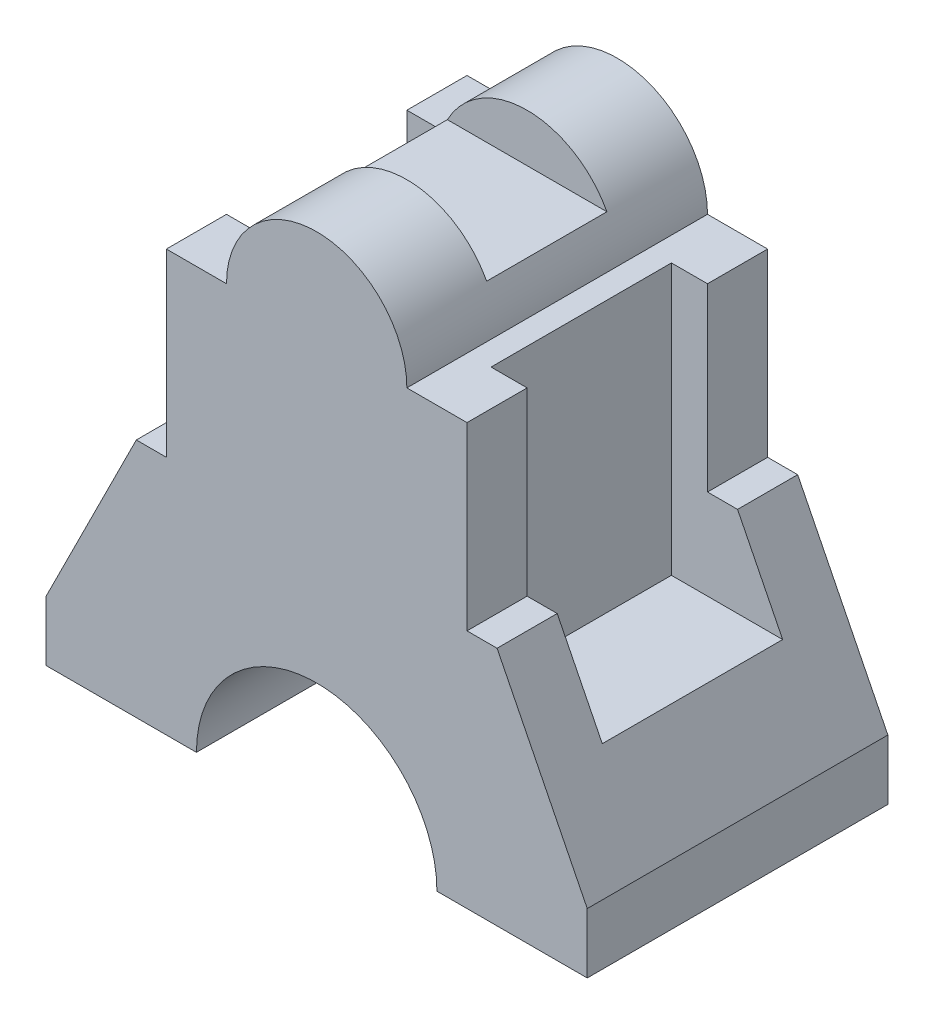
ISO-10303-21;
HEADER;
FILE_DESCRIPTION(('STEP AP214'),'2;1');
FILE_NAME('part.step','',(''),(''),'','','');
FILE_SCHEMA(('AUTOMOTIVE_DESIGN { 1 0 10303 214 1 1 1 1 }'));
ENDSEC;
DATA;
#1=APPLICATION_CONTEXT('core data for automotive mechanical design processes');
#2=APPLICATION_PROTOCOL_DEFINITION('international standard','automotive_design',2000,#1);
#3=PRODUCT_CONTEXT('',#1,'mechanical');
#4=PRODUCT('Part','Part','',(#3));
#5=PRODUCT_RELATED_PRODUCT_CATEGORY('part','',(#4));
#6=PRODUCT_DEFINITION_FORMATION('','',#4);
#7=PRODUCT_DEFINITION_CONTEXT('part definition',#1,'design');
#8=PRODUCT_DEFINITION('design','',#6,#7);
#9=PRODUCT_DEFINITION_SHAPE('','',#8);
#10=(LENGTH_UNIT() NAMED_UNIT(*) SI_UNIT(.MILLI.,.METRE.));
#11=(NAMED_UNIT(*) PLANE_ANGLE_UNIT() SI_UNIT($,.RADIAN.));
#12=(NAMED_UNIT(*) SI_UNIT($,.STERADIAN.) SOLID_ANGLE_UNIT());
#13=UNCERTAINTY_MEASURE_WITH_UNIT(LENGTH_MEASURE(1.E-05),#10,'distance_accuracy_value','');
#14=(GEOMETRIC_REPRESENTATION_CONTEXT(3) GLOBAL_UNCERTAINTY_ASSIGNED_CONTEXT((#13)) GLOBAL_UNIT_ASSIGNED_CONTEXT((#10,
#11,#12)) REPRESENTATION_CONTEXT('',''));
#15=CARTESIAN_POINT('',(0.,0.,0.));
#16=DIRECTION('',(0.,0.,1.));
#17=DIRECTION('',(1.,0.,0.));
#18=AXIS2_PLACEMENT_3D('',#15,#16,#17);
#19=CARTESIAN_POINT('',(-25.,0.,25.));
#20=DIRECTION('',(1.,0.,0.));
#21=DIRECTION('',(0.,1.,0.));
#22=AXIS2_PLACEMENT_3D('',#19,#20,#21);
#23=PLANE('',#22);
#24=DIRECTION('',(0.,0.,-1.));
#25=VECTOR('',#24,1.);
#26=CARTESIAN_POINT('',(-25.,70.,25.));
#27=LINE('',#26,#25);
#28=CARTESIAN_POINT('',(-25.,70.,25.));
#29=VERTEX_POINT('',#28);
#30=CARTESIAN_POINT('',(-25.,70.,15.));
#31=VERTEX_POINT('',#30);
#32=EDGE_CURVE('E478',#29,#31,#27,.T.);
#33=ORIENTED_EDGE('',*,*,#32,.T.);
#34=DIRECTION('',(0.,-1.,0.));
#35=VECTOR('',#34,1.);
#36=CARTESIAN_POINT('',(-25.,0.,15.));
#37=LINE('',#36,#35);
#38=CARTESIAN_POINT('',(-25.,40.,15.));
#39=VERTEX_POINT('',#38);
#40=EDGE_CURVE('E319',#31,#39,#37,.T.);
#41=ORIENTED_EDGE('',*,*,#40,.T.);
#42=DIRECTION('',(0.,0.,-1.));
#43=VECTOR('',#42,1.);
#44=CARTESIAN_POINT('',(-25.,40.,25.));
#45=LINE('',#44,#43);
#46=CARTESIAN_POINT('',(-25.,40.,25.));
#47=VERTEX_POINT('',#46);
#48=EDGE_CURVE('E473',#47,#39,#45,.T.);
#49=ORIENTED_EDGE('',*,*,#48,.F.);
#50=DIRECTION('',(0.,-1.,0.));
#51=VECTOR('',#50,1.);
#52=CARTESIAN_POINT('',(-25.,0.,25.));
#53=LINE('',#52,#51);
#54=EDGE_CURVE('E354',#29,#47,#53,.T.);
#55=ORIENTED_EDGE('',*,*,#54,.F.);
#56=EDGE_LOOP('',(#33,#41,#49,#55));
#57=FACE_BOUND('',#56,.T.);
#58=ADVANCED_FACE('F41',(#57),#23,.F.);
#59=CARTESIAN_POINT('',(0.,40.,25.));
#60=DIRECTION('',(0.,-1.,0.));
#61=DIRECTION('',(0.,0.,-1.));
#62=AXIS2_PLACEMENT_3D('',#59,#60,#61);
#63=PLANE('',#62);
#64=ORIENTED_EDGE('',*,*,#48,.T.);
#65=DIRECTION('',(-1.,0.,0.));
#66=VECTOR('',#65,1.);
#67=CARTESIAN_POINT('',(0.,40.,15.));
#68=LINE('',#67,#66);
#69=CARTESIAN_POINT('',(-30.,40.,15.));
#70=VERTEX_POINT('',#69);
#71=EDGE_CURVE('E315',#39,#70,#68,.T.);
#72=ORIENTED_EDGE('',*,*,#71,.T.);
#73=DIRECTION('',(0.,0.,-1.));
#74=VECTOR('',#73,1.);
#75=CARTESIAN_POINT('',(-30.,40.,25.));
#76=LINE('',#75,#74);
#77=CARTESIAN_POINT('',(-30.,40.,25.));
#78=VERTEX_POINT('',#77);
#79=EDGE_CURVE('E468',#78,#70,#76,.T.);
#80=ORIENTED_EDGE('',*,*,#79,.F.);
#81=DIRECTION('',(-1.,0.,0.));
#82=VECTOR('',#81,1.);
#83=CARTESIAN_POINT('',(0.,40.,25.));
#84=LINE('',#83,#82);
#85=EDGE_CURVE('E357',#47,#78,#84,.T.);
#86=ORIENTED_EDGE('',*,*,#85,.F.);
#87=EDGE_LOOP('',(#64,#72,#80,#86));
#88=FACE_BOUND('',#87,.T.);
#89=ADVANCED_FACE('F587',(#88),#63,.F.);
#90=CARTESIAN_POINT('',(0.,40.,25.));
#91=DIRECTION('',(0.,-1.,0.));
#92=DIRECTION('',(0.,0.,-1.));
#93=AXIS2_PLACEMENT_3D('',#90,#91,#92);
#94=PLANE('',#93);
#95=DIRECTION('',(0.,0.,-1.));
#96=VECTOR('',#95,1.);
#97=CARTESIAN_POINT('',(25.,40.,25.));
#98=LINE('',#97,#96);
#99=CARTESIAN_POINT('',(25.,40.,-15.));
#100=VERTEX_POINT('',#99);
#101=CARTESIAN_POINT('',(25.,40.,-25.));
#102=VERTEX_POINT('',#101);
#103=EDGE_CURVE('E443',#100,#102,#98,.T.);
#104=ORIENTED_EDGE('',*,*,#103,.F.);
#105=DIRECTION('',(1.,0.,0.));
#106=VECTOR('',#105,1.);
#107=CARTESIAN_POINT('',(0.,40.,-15.));
#108=LINE('',#107,#106);
#109=CARTESIAN_POINT('',(30.,40.,-15.));
#110=VERTEX_POINT('',#109);
#111=EDGE_CURVE('E299',#100,#110,#108,.T.);
#112=ORIENTED_EDGE('',*,*,#111,.T.);
#113=DIRECTION('',(0.,0.,-1.));
#114=VECTOR('',#113,1.);
#115=CARTESIAN_POINT('',(30.,40.,25.));
#116=LINE('',#115,#114);
#117=CARTESIAN_POINT('',(30.,40.,-25.));
#118=VERTEX_POINT('',#117);
#119=EDGE_CURVE('E448',#110,#118,#116,.T.);
#120=ORIENTED_EDGE('',*,*,#119,.T.);
#121=DIRECTION('',(-1.,0.,0.));
#122=VECTOR('',#121,1.);
#123=CARTESIAN_POINT('',(0.,40.,-25.));
#124=LINE('',#123,#122);
#125=EDGE_CURVE('E425',#118,#102,#124,.T.);
#126=ORIENTED_EDGE('',*,*,#125,.T.);
#127=EDGE_LOOP('',(#104,#112,#120,#126));
#128=FACE_BOUND('',#127,.T.);
#129=ADVANCED_FACE('F564',(#128),#94,.F.);
#130=CARTESIAN_POINT('',(25.,0.,25.));
#131=DIRECTION('',(1.,0.,0.));
#132=DIRECTION('',(0.,1.,0.));
#133=AXIS2_PLACEMENT_3D('',#130,#131,#132);
#134=PLANE('',#133);
#135=DIRECTION('',(0.,1.,0.));
#136=VECTOR('',#135,1.);
#137=CARTESIAN_POINT('',(25.,0.,-15.));
#138=LINE('',#137,#136);
#139=CARTESIAN_POINT('',(25.,70.,-15.));
#140=VERTEX_POINT('',#139);
#141=EDGE_CURVE('E296',#100,#140,#138,.T.);
#142=ORIENTED_EDGE('',*,*,#141,.F.);
#143=ORIENTED_EDGE('',*,*,#103,.T.);
#144=DIRECTION('',(0.,-1.,0.));
#145=VECTOR('',#144,1.);
#146=CARTESIAN_POINT('',(25.,0.,-25.));
#147=LINE('',#146,#145);
#148=CARTESIAN_POINT('',(25.,70.,-25.));
#149=VERTEX_POINT('',#148);
#150=EDGE_CURVE('E429',#149,#102,#147,.T.);
#151=ORIENTED_EDGE('',*,*,#150,.F.);
#152=DIRECTION('',(0.,0.,-1.));
#153=VECTOR('',#152,1.);
#154=CARTESIAN_POINT('',(25.,70.,25.));
#155=LINE('',#154,#153);
#156=EDGE_CURVE('E438',#140,#149,#155,.T.);
#157=ORIENTED_EDGE('',*,*,#156,.F.);
#158=EDGE_LOOP('',(#142,#143,#151,#157));
#159=FACE_BOUND('',#158,.T.);
#160=ADVANCED_FACE('F561',(#159),#134,.T.);
#161=CARTESIAN_POINT('',(0.,0.,25.));
#162=DIRECTION('',(0.,-1.,0.));
#163=DIRECTION('',(0.,0.,-1.));
#164=AXIS2_PLACEMENT_3D('',#161,#162,#163);
#165=PLANE('',#164);
#166=DIRECTION('',(0.,0.,-1.));
#167=VECTOR('',#166,1.);
#168=CARTESIAN_POINT('',(-20.,0.,25.));
#169=LINE('',#168,#167);
#170=CARTESIAN_POINT('',(-20.,0.,25.));
#171=VERTEX_POINT('',#170);
#172=CARTESIAN_POINT('',(-20.,0.,-25.));
#173=VERTEX_POINT('',#172);
#174=EDGE_CURVE('E331',#171,#173,#169,.T.);
#175=ORIENTED_EDGE('',*,*,#174,.F.);
#176=DIRECTION('',(-1.,0.,0.));
#177=VECTOR('',#176,1.);
#178=CARTESIAN_POINT('',(0.,0.,25.));
#179=LINE('',#178,#177);
#180=CARTESIAN_POINT('',(-45.,0.,25.));
#181=VERTEX_POINT('',#180);
#182=EDGE_CURVE('E368',#171,#181,#179,.T.);
#183=ORIENTED_EDGE('',*,*,#182,.T.);
#184=DIRECTION('',(0.,0.,-1.));
#185=VECTOR('',#184,1.);
#186=CARTESIAN_POINT('',(-45.,0.,25.));
#187=LINE('',#186,#185);
#188=CARTESIAN_POINT('',(-45.,0.,-25.));
#189=VERTEX_POINT('',#188);
#190=EDGE_CURVE('E460',#181,#189,#187,.T.);
#191=ORIENTED_EDGE('',*,*,#190,.T.);
#192=DIRECTION('',(-1.,0.,0.));
#193=VECTOR('',#192,1.);
#194=CARTESIAN_POINT('',(0.,0.,-25.));
#195=LINE('',#194,#193);
#196=EDGE_CURVE('E413',#173,#189,#195,.T.);
#197=ORIENTED_EDGE('',*,*,#196,.F.);
#198=EDGE_LOOP('',(#175,#183,#191,#197));
#199=FACE_BOUND('',#198,.T.);
#200=ADVANCED_FACE('F525',(#199),#165,.T.);
#201=CARTESIAN_POINT('',(0.,70.,25.));
#202=DIRECTION('',(0.,0.,-1.));
#203=DIRECTION('',(-1.,0.,0.));
#204=AXIS2_PLACEMENT_3D('',#201,#202,#203);
#205=CYLINDRICAL_SURFACE('',#204,15.);
#206=CARTESIAN_POINT('',(0.,70.,10.));
#207=DIRECTION('',(0.,0.,1.));
#208=DIRECTION('',(1.,0.,0.));
#209=AXIS2_PLACEMENT_3D('',#206,#207,#208);
#210=CIRCLE('',#209,15.);
#211=CARTESIAN_POINT('',(-13.2664991614216,77.,10.));
#212=VERTEX_POINT('',#211);
#213=CARTESIAN_POINT('',(13.2664991614216,77.,10.));
#214=VERTEX_POINT('',#213);
#215=EDGE_CURVE('E485',#212,#214,#210,.F.);
#216=ORIENTED_EDGE('',*,*,#215,.F.);
#217=DIRECTION('',(0.,0.,-1.));
#218=VECTOR('',#217,1.);
#219=CARTESIAN_POINT('',(-13.2664991614216,77.,25.));
#220=LINE('',#219,#218);
#221=CARTESIAN_POINT('',(-13.2664991614216,77.,-10.));
#222=VERTEX_POINT('',#221);
#223=EDGE_CURVE('E494',#222,#212,#220,.F.);
#224=ORIENTED_EDGE('',*,*,#223,.F.);
#225=CARTESIAN_POINT('',(0.,70.,-10.));
#226=DIRECTION('',(0.,0.,-1.));
#227=DIRECTION('',(0.,1.,0.));
#228=AXIS2_PLACEMENT_3D('',#225,#226,#227);
#229=CIRCLE('',#228,15.);
#230=CARTESIAN_POINT('',(13.2664991614216,77.,-10.));
#231=VERTEX_POINT('',#230);
#232=EDGE_CURVE('E491',#231,#222,#229,.F.);
#233=ORIENTED_EDGE('',*,*,#232,.F.);
#234=DIRECTION('',(0.,0.,-1.));
#235=VECTOR('',#234,1.);
#236=CARTESIAN_POINT('',(13.2664991614216,77.,25.));
#237=LINE('',#236,#235);
#238=EDGE_CURVE('E488',#214,#231,#237,.T.);
#239=ORIENTED_EDGE('',*,*,#238,.F.);
#240=EDGE_LOOP('',(#216,#224,#233,#239));
#241=FACE_BOUND('',#240,.T.);
#242=CARTESIAN_POINT('',(0.,70.,-25.));
#243=DIRECTION('',(0.,0.,1.));
#244=DIRECTION('',(1.,0.,0.));
#245=AXIS2_PLACEMENT_3D('',#242,#243,#244);
#246=CIRCLE('',#245,15.);
#247=CARTESIAN_POINT('',(-15.,70.,-25.));
#248=VERTEX_POINT('',#247);
#249=CARTESIAN_POINT('',(15.,70.,-25.));
#250=VERTEX_POINT('',#249);
#251=EDGE_CURVE('E342',#248,#250,#246,.F.);
#252=ORIENTED_EDGE('',*,*,#251,.F.);
#253=DIRECTION('',(0.,0.,-1.));
#254=VECTOR('',#253,1.);
#255=CARTESIAN_POINT('',(-15.,70.,25.));
#256=LINE('',#255,#254);
#257=CARTESIAN_POINT('',(-15.,70.,25.));
#258=VERTEX_POINT('',#257);
#259=EDGE_CURVE('E482',#258,#248,#256,.T.);
#260=ORIENTED_EDGE('',*,*,#259,.F.);
#261=CARTESIAN_POINT('',(0.,70.,25.));
#262=DIRECTION('',(0.,0.,1.));
#263=DIRECTION('',(1.,0.,0.));
#264=AXIS2_PLACEMENT_3D('',#261,#262,#263);
#265=CIRCLE('',#264,15.);
#266=CARTESIAN_POINT('',(15.,70.,25.));
#267=VERTEX_POINT('',#266);
#268=EDGE_CURVE('E346',#258,#267,#265,.F.);
#269=ORIENTED_EDGE('',*,*,#268,.T.);
#270=DIRECTION('',(0.,0.,-1.));
#271=VECTOR('',#270,1.);
#272=CARTESIAN_POINT('',(15.,70.,25.));
#273=LINE('',#272,#271);
#274=EDGE_CURVE('E389',#267,#250,#273,.T.);
#275=ORIENTED_EDGE('',*,*,#274,.T.);
#276=EDGE_LOOP('',(#252,#260,#269,#275));
#277=FACE_BOUND('',#276,.T.);
#278=ADVANCED_FACE('F43',(#241,#277),#205,.T.);
#279=CARTESIAN_POINT('',(0.,70.,25.));
#280=DIRECTION('',(0.,-1.,0.));
#281=DIRECTION('',(0.,0.,-1.));
#282=AXIS2_PLACEMENT_3D('',#279,#280,#281);
#283=PLANE('',#282);
#284=DIRECTION('',(0.,0.,-1.));
#285=VECTOR('',#284,1.);
#286=CARTESIAN_POINT('',(-19.,70.,15.));
#287=LINE('',#286,#285);
#288=CARTESIAN_POINT('',(-19.,70.,15.));
#289=VERTEX_POINT('',#288);
#290=CARTESIAN_POINT('',(-19.,70.,-15.));
#291=VERTEX_POINT('',#290);
#292=EDGE_CURVE('E233',#289,#291,#287,.T.);
#293=ORIENTED_EDGE('',*,*,#292,.F.);
#294=DIRECTION('',(1.,0.,0.));
#295=VECTOR('',#294,1.);
#296=CARTESIAN_POINT('',(-19.,70.,15.));
#297=LINE('',#296,#295);
#298=EDGE_CURVE('E249',#31,#289,#297,.T.);
#299=ORIENTED_EDGE('',*,*,#298,.F.);
#300=ORIENTED_EDGE('',*,*,#32,.F.);
#301=DIRECTION('',(-1.,0.,0.));
#302=VECTOR('',#301,1.);
#303=CARTESIAN_POINT('',(0.,70.,25.));
#304=LINE('',#303,#302);
#305=EDGE_CURVE('E350',#258,#29,#304,.T.);
#306=ORIENTED_EDGE('',*,*,#305,.F.);
#307=ORIENTED_EDGE('',*,*,#259,.T.);
#308=DIRECTION('',(-1.,0.,0.));
#309=VECTOR('',#308,1.);
#310=CARTESIAN_POINT('',(0.,70.,-25.));
#311=LINE('',#310,#309);
#312=CARTESIAN_POINT('',(-25.,70.,-25.));
#313=VERTEX_POINT('',#312);
#314=EDGE_CURVE('E393',#248,#313,#311,.T.);
#315=ORIENTED_EDGE('',*,*,#314,.T.);
#316=CARTESIAN_POINT('',(-25.,70.,-15.));
#317=VERTEX_POINT('',#316);
#318=EDGE_CURVE('E477',#317,#313,#27,.T.);
#319=ORIENTED_EDGE('',*,*,#318,.F.);
#320=DIRECTION('',(-1.,0.,0.));
#321=VECTOR('',#320,1.);
#322=CARTESIAN_POINT('',(-19.,70.,-15.));
#323=LINE('',#322,#321);
#324=EDGE_CURVE('E252',#291,#317,#323,.T.);
#325=ORIENTED_EDGE('',*,*,#324,.F.);
#326=EDGE_LOOP('',(#293,#299,#300,#306,#307,#315,#319,#325));
#327=FACE_BOUND('',#326,.T.);
#328=ADVANCED_FACE('F546',(#327),#283,.F.);
#329=CARTESIAN_POINT('',(-25.,40.,-15.));
#330=VERTEX_POINT('',#329);
#331=CARTESIAN_POINT('',(-25.,40.,-25.));
#332=VERTEX_POINT('',#331);
#333=EDGE_CURVE('E472',#330,#332,#45,.T.);
#334=ORIENTED_EDGE('',*,*,#333,.F.);
#335=DIRECTION('',(0.,1.,0.));
#336=VECTOR('',#335,1.);
#337=CARTESIAN_POINT('',(-25.,0.,-15.));
#338=LINE('',#337,#336);
#339=EDGE_CURVE('E311',#330,#317,#338,.T.);
#340=ORIENTED_EDGE('',*,*,#339,.T.);
#341=ORIENTED_EDGE('',*,*,#318,.T.);
#342=DIRECTION('',(0.,-1.,0.));
#343=VECTOR('',#342,1.);
#344=CARTESIAN_POINT('',(-25.,0.,-25.));
#345=LINE('',#344,#343);
#346=EDGE_CURVE('E397',#313,#332,#345,.T.);
#347=ORIENTED_EDGE('',*,*,#346,.T.);
#348=EDGE_LOOP('',(#334,#340,#341,#347));
#349=FACE_BOUND('',#348,.T.);
#350=ADVANCED_FACE('F543',(#349),#23,.F.);
#351=CARTESIAN_POINT('',(-30.,40.,-15.));
#352=VERTEX_POINT('',#351);
#353=CARTESIAN_POINT('',(-30.,40.,-25.));
#354=VERTEX_POINT('',#353);
#355=EDGE_CURVE('E467',#352,#354,#76,.T.);
#356=ORIENTED_EDGE('',*,*,#355,.F.);
#357=DIRECTION('',(1.,0.,0.));
#358=VECTOR('',#357,1.);
#359=CARTESIAN_POINT('',(0.,40.,-15.));
#360=LINE('',#359,#358);
#361=EDGE_CURVE('E307',#352,#330,#360,.T.);
#362=ORIENTED_EDGE('',*,*,#361,.T.);
#363=ORIENTED_EDGE('',*,*,#333,.T.);
#364=DIRECTION('',(-1.,0.,0.));
#365=VECTOR('',#364,1.);
#366=CARTESIAN_POINT('',(0.,40.,-25.));
#367=LINE('',#366,#365);
#368=EDGE_CURVE('E401',#332,#354,#367,.T.);
#369=ORIENTED_EDGE('',*,*,#368,.T.);
#370=EDGE_LOOP('',(#356,#362,#363,#369));
#371=FACE_BOUND('',#370,.T.);
#372=ADVANCED_FACE('F540',(#371),#63,.F.);
#373=CARTESIAN_POINT('',(-40.,20.,25.));
#374=DIRECTION('',(-0.894427190999916,0.447213595499958,0.));
#375=DIRECTION('',(-0.447213595499958,-0.894427190999916,0.));
#376=AXIS2_PLACEMENT_3D('',#373,#374,#375);
#377=PLANE('',#376);
#378=DIRECTION('',(0.447213595499958,0.894427190999916,0.));
#379=VECTOR('',#378,1.);
#380=CARTESIAN_POINT('',(-40.,20.,15.));
#381=LINE('',#380,#379);
#382=CARTESIAN_POINT('',(-37.5,25.,15.));
#383=VERTEX_POINT('',#382);
#384=EDGE_CURVE('E11',#383,#70,#381,.T.);
#385=ORIENTED_EDGE('',*,*,#384,.F.);
#386=DIRECTION('',(0.,0.,-1.));
#387=VECTOR('',#386,1.);
#388=CARTESIAN_POINT('',(-37.5,25.,25.));
#389=LINE('',#388,#387);
#390=CARTESIAN_POINT('',(-37.5,25.,-15.));
#391=VERTEX_POINT('',#390);
#392=EDGE_CURVE('E506',#383,#391,#389,.T.);
#393=ORIENTED_EDGE('',*,*,#392,.T.);
#394=DIRECTION('',(-0.447213595499958,-0.894427190999916,0.));
#395=VECTOR('',#394,1.);
#396=CARTESIAN_POINT('',(-40.,20.,-15.));
#397=LINE('',#396,#395);
#398=EDGE_CURVE('E50',#352,#391,#397,.T.);
#399=ORIENTED_EDGE('',*,*,#398,.F.);
#400=ORIENTED_EDGE('',*,*,#355,.T.);
#401=DIRECTION('',(0.447213595499958,0.894427190999916,0.));
#402=VECTOR('',#401,1.);
#403=CARTESIAN_POINT('',(-40.,20.,-25.));
#404=LINE('',#403,#402);
#405=CARTESIAN_POINT('',(-45.,9.99999999999999,-25.));
#406=VERTEX_POINT('',#405);
#407=EDGE_CURVE('E405',#406,#354,#404,.T.);
#408=ORIENTED_EDGE('',*,*,#407,.F.);
#409=DIRECTION('',(0.,0.,-1.));
#410=VECTOR('',#409,1.);
#411=CARTESIAN_POINT('',(-45.,9.99999999999999,25.));
#412=LINE('',#411,#410);
#413=CARTESIAN_POINT('',(-45.,9.99999999999999,25.));
#414=VERTEX_POINT('',#413);
#415=EDGE_CURVE('E464',#414,#406,#412,.T.);
#416=ORIENTED_EDGE('',*,*,#415,.F.);
#417=DIRECTION('',(0.447213595499958,0.894427190999916,0.));
#418=VECTOR('',#417,1.);
#419=CARTESIAN_POINT('',(-40.,20.,25.));
#420=LINE('',#419,#418);
#421=EDGE_CURVE('E360',#414,#78,#420,.T.);
#422=ORIENTED_EDGE('',*,*,#421,.T.);
#423=ORIENTED_EDGE('',*,*,#79,.T.);
#424=EDGE_LOOP('',(#385,#393,#399,#400,#408,#416,#422,#423));
#425=FACE_BOUND('',#424,.T.);
#426=ADVANCED_FACE('F534',(#425),#377,.T.);
#427=CARTESIAN_POINT('',(-45.,0.,25.));
#428=DIRECTION('',(-1.,0.,0.));
#429=DIRECTION('',(0.,0.,1.));
#430=AXIS2_PLACEMENT_3D('',#427,#428,#429);
#431=PLANE('',#430);
#432=DIRECTION('',(0.,1.,0.));
#433=VECTOR('',#432,1.);
#434=CARTESIAN_POINT('',(-45.,0.,-25.));
#435=LINE('',#434,#433);
#436=EDGE_CURVE('E409',#189,#406,#435,.T.);
#437=ORIENTED_EDGE('',*,*,#436,.F.);
#438=ORIENTED_EDGE('',*,*,#190,.F.);
#439=DIRECTION('',(0.,1.,0.));
#440=VECTOR('',#439,1.);
#441=CARTESIAN_POINT('',(-45.,0.,25.));
#442=LINE('',#441,#440);
#443=EDGE_CURVE('E364',#181,#414,#442,.T.);
#444=ORIENTED_EDGE('',*,*,#443,.T.);
#445=ORIENTED_EDGE('',*,*,#415,.T.);
#446=EDGE_LOOP('',(#437,#438,#444,#445));
#447=FACE_BOUND('',#446,.T.);
#448=ADVANCED_FACE('F529',(#447),#431,.T.);
#449=DIRECTION('',(0.,0.,-1.));
#450=VECTOR('',#449,1.);
#451=CARTESIAN_POINT('',(20.,0.,25.));
#452=LINE('',#451,#450);
#453=CARTESIAN_POINT('',(20.,0.,25.));
#454=VERTEX_POINT('',#453);
#455=CARTESIAN_POINT('',(20.,0.,-25.));
#456=VERTEX_POINT('',#455);
#457=EDGE_CURVE('E328',#454,#456,#452,.T.);
#458=ORIENTED_EDGE('',*,*,#457,.T.);
#459=CARTESIAN_POINT('',(45.,0.,-25.));
#460=VERTEX_POINT('',#459);
#461=EDGE_CURVE('E414',#460,#456,#195,.T.);
#462=ORIENTED_EDGE('',*,*,#461,.F.);
#463=DIRECTION('',(0.,0.,-1.));
#464=VECTOR('',#463,1.);
#465=CARTESIAN_POINT('',(45.,0.,25.));
#466=LINE('',#465,#464);
#467=CARTESIAN_POINT('',(45.,0.,25.));
#468=VERTEX_POINT('',#467);
#469=EDGE_CURVE('E457',#468,#460,#466,.T.);
#470=ORIENTED_EDGE('',*,*,#469,.F.);
#471=EDGE_CURVE('E369',#468,#454,#179,.T.);
#472=ORIENTED_EDGE('',*,*,#471,.T.);
#473=EDGE_LOOP('',(#458,#462,#470,#472));
#474=FACE_BOUND('',#473,.T.);
#475=ADVANCED_FACE('F579',(#474),#165,.T.);
#476=CARTESIAN_POINT('',(45.,0.,25.));
#477=DIRECTION('',(-1.,0.,0.));
#478=DIRECTION('',(0.,0.,1.));
#479=AXIS2_PLACEMENT_3D('',#476,#477,#478);
#480=PLANE('',#479);
#481=DIRECTION('',(0.,1.,0.));
#482=VECTOR('',#481,1.);
#483=CARTESIAN_POINT('',(45.,0.,-25.));
#484=LINE('',#483,#482);
#485=CARTESIAN_POINT('',(45.,9.99999999999999,-25.));
#486=VERTEX_POINT('',#485);
#487=EDGE_CURVE('E418',#460,#486,#484,.T.);
#488=ORIENTED_EDGE('',*,*,#487,.T.);
#489=DIRECTION('',(0.,0.,-1.));
#490=VECTOR('',#489,1.);
#491=CARTESIAN_POINT('',(45.,9.99999999999999,25.));
#492=LINE('',#491,#490);
#493=CARTESIAN_POINT('',(45.,9.99999999999999,25.));
#494=VERTEX_POINT('',#493);
#495=EDGE_CURVE('E453',#494,#486,#492,.T.);
#496=ORIENTED_EDGE('',*,*,#495,.F.);
#497=DIRECTION('',(0.,1.,0.));
#498=VECTOR('',#497,1.);
#499=CARTESIAN_POINT('',(45.,0.,25.));
#500=LINE('',#499,#498);
#501=EDGE_CURVE('E373',#468,#494,#500,.T.);
#502=ORIENTED_EDGE('',*,*,#501,.F.);
#503=ORIENTED_EDGE('',*,*,#469,.T.);
#504=EDGE_LOOP('',(#488,#496,#502,#503));
#505=FACE_BOUND('',#504,.T.);
#506=ADVANCED_FACE('F576',(#505),#480,.F.);
#507=CARTESIAN_POINT('',(40.,20.,25.));
#508=DIRECTION('',(-0.894427190999916,-0.447213595499958,0.));
#509=DIRECTION('',(0.447213595499958,-0.894427190999916,0.));
#510=AXIS2_PLACEMENT_3D('',#507,#508,#509);
#511=PLANE('',#510);
#512=ORIENTED_EDGE('',*,*,#119,.F.);
#513=DIRECTION('',(0.447213595499958,-0.894427190999916,0.));
#514=VECTOR('',#513,1.);
#515=CARTESIAN_POINT('',(40.,20.,-15.));
#516=LINE('',#515,#514);
#517=CARTESIAN_POINT('',(37.5,25.,-15.));
#518=VERTEX_POINT('',#517);
#519=EDGE_CURVE('E303',#110,#518,#516,.T.);
#520=ORIENTED_EDGE('',*,*,#519,.T.);
#521=DIRECTION('',(0.,0.,1.));
#522=VECTOR('',#521,1.);
#523=CARTESIAN_POINT('',(37.5,25.,25.));
#524=LINE('',#523,#522);
#525=CARTESIAN_POINT('',(37.5,25.,15.));
#526=VERTEX_POINT('',#525);
#527=EDGE_CURVE('E502',#518,#526,#524,.T.);
#528=ORIENTED_EDGE('',*,*,#527,.T.);
#529=DIRECTION('',(-0.447213595499958,0.894427190999916,0.));
#530=VECTOR('',#529,1.);
#531=CARTESIAN_POINT('',(40.,20.,15.));
#532=LINE('',#531,#530);
#533=CARTESIAN_POINT('',(30.,40.,15.));
#534=VERTEX_POINT('',#533);
#535=EDGE_CURVE('E292',#526,#534,#532,.T.);
#536=ORIENTED_EDGE('',*,*,#535,.T.);
#537=CARTESIAN_POINT('',(30.,40.,25.));
#538=VERTEX_POINT('',#537);
#539=EDGE_CURVE('E449',#538,#534,#116,.T.);
#540=ORIENTED_EDGE('',*,*,#539,.F.);
#541=DIRECTION('',(-0.447213595499958,0.894427190999916,0.));
#542=VECTOR('',#541,1.);
#543=CARTESIAN_POINT('',(40.,20.,25.));
#544=LINE('',#543,#542);
#545=EDGE_CURVE('E376',#494,#538,#544,.T.);
#546=ORIENTED_EDGE('',*,*,#545,.F.);
#547=ORIENTED_EDGE('',*,*,#495,.T.);
#548=DIRECTION('',(-0.447213595499958,0.894427190999916,0.));
#549=VECTOR('',#548,1.);
#550=CARTESIAN_POINT('',(40.,20.,-25.));
#551=LINE('',#550,#549);
#552=EDGE_CURVE('E421',#486,#118,#551,.T.);
#553=ORIENTED_EDGE('',*,*,#552,.T.);
#554=EDGE_LOOP('',(#512,#520,#528,#536,#540,#546,#547,#553));
#555=FACE_BOUND('',#554,.T.);
#556=ADVANCED_FACE('F570',(#555),#511,.F.);
#557=ORIENTED_EDGE('',*,*,#539,.T.);
#558=DIRECTION('',(-1.,0.,0.));
#559=VECTOR('',#558,1.);
#560=CARTESIAN_POINT('',(0.,40.,15.));
#561=LINE('',#560,#559);
#562=CARTESIAN_POINT('',(25.,40.,15.));
#563=VERTEX_POINT('',#562);
#564=EDGE_CURVE('E288',#534,#563,#561,.T.);
#565=ORIENTED_EDGE('',*,*,#564,.T.);
#566=CARTESIAN_POINT('',(25.,40.,25.));
#567=VERTEX_POINT('',#566);
#568=EDGE_CURVE('E444',#567,#563,#98,.T.);
#569=ORIENTED_EDGE('',*,*,#568,.F.);
#570=DIRECTION('',(-1.,0.,0.));
#571=VECTOR('',#570,1.);
#572=CARTESIAN_POINT('',(0.,40.,25.));
#573=LINE('',#572,#571);
#574=EDGE_CURVE('E379',#538,#567,#573,.T.);
#575=ORIENTED_EDGE('',*,*,#574,.F.);
#576=EDGE_LOOP('',(#557,#565,#569,#575));
#577=FACE_BOUND('',#576,.T.);
#578=ADVANCED_FACE('F605',(#577),#94,.F.);
#579=DIRECTION('',(0.,-1.,0.));
#580=VECTOR('',#579,1.);
#581=CARTESIAN_POINT('',(25.,0.,15.));
#582=LINE('',#581,#580);
#583=CARTESIAN_POINT('',(25.,70.,15.));
#584=VERTEX_POINT('',#583);
#585=EDGE_CURVE('E263',#584,#563,#582,.T.);
#586=ORIENTED_EDGE('',*,*,#585,.F.);
#587=CARTESIAN_POINT('',(25.,70.,25.));
#588=VERTEX_POINT('',#587);
#589=EDGE_CURVE('E439',#588,#584,#155,.T.);
#590=ORIENTED_EDGE('',*,*,#589,.F.);
#591=DIRECTION('',(0.,-1.,0.));
#592=VECTOR('',#591,1.);
#593=CARTESIAN_POINT('',(25.,0.,25.));
#594=LINE('',#593,#592);
#595=EDGE_CURVE('E382',#588,#567,#594,.T.);
#596=ORIENTED_EDGE('',*,*,#595,.T.);
#597=ORIENTED_EDGE('',*,*,#568,.T.);
#598=EDGE_LOOP('',(#586,#590,#596,#597));
#599=FACE_BOUND('',#598,.T.);
#600=ADVANCED_FACE('F599',(#599),#134,.T.);
#601=CARTESIAN_POINT('',(0.,70.,25.));
#602=DIRECTION('',(0.,-1.,0.));
#603=DIRECTION('',(0.,0.,-1.));
#604=AXIS2_PLACEMENT_3D('',#601,#602,#603);
#605=PLANE('',#604);
#606=DIRECTION('',(0.,0.,1.));
#607=VECTOR('',#606,1.);
#608=CARTESIAN_POINT('',(19.,70.,15.));
#609=LINE('',#608,#607);
#610=CARTESIAN_POINT('',(19.,70.,-15.));
#611=VERTEX_POINT('',#610);
#612=CARTESIAN_POINT('',(19.,70.,15.));
#613=VERTEX_POINT('',#612);
#614=EDGE_CURVE('E65',#611,#613,#609,.T.);
#615=ORIENTED_EDGE('',*,*,#614,.F.);
#616=DIRECTION('',(1.,0.,0.));
#617=VECTOR('',#616,1.);
#618=CARTESIAN_POINT('',(0.,70.,-15.));
#619=LINE('',#618,#617);
#620=EDGE_CURVE('E498',#611,#140,#619,.T.);
#621=ORIENTED_EDGE('',*,*,#620,.T.);
#622=ORIENTED_EDGE('',*,*,#156,.T.);
#623=DIRECTION('',(-1.,0.,0.));
#624=VECTOR('',#623,1.);
#625=CARTESIAN_POINT('',(0.,70.,-25.));
#626=LINE('',#625,#624);
#627=EDGE_CURVE('E351',#149,#250,#626,.T.);
#628=ORIENTED_EDGE('',*,*,#627,.T.);
#629=ORIENTED_EDGE('',*,*,#274,.F.);
#630=DIRECTION('',(-1.,0.,0.));
#631=VECTOR('',#630,1.);
#632=CARTESIAN_POINT('',(0.,70.,25.));
#633=LINE('',#632,#631);
#634=EDGE_CURVE('E386',#588,#267,#633,.T.);
#635=ORIENTED_EDGE('',*,*,#634,.F.);
#636=ORIENTED_EDGE('',*,*,#589,.T.);
#637=DIRECTION('',(1.,0.,0.));
#638=VECTOR('',#637,1.);
#639=CARTESIAN_POINT('',(19.,70.,15.));
#640=LINE('',#639,#638);
#641=EDGE_CURVE('E270',#613,#584,#640,.T.);
#642=ORIENTED_EDGE('',*,*,#641,.F.);
#643=EDGE_LOOP('',(#615,#621,#622,#628,#629,#635,#636,#642));
#644=FACE_BOUND('',#643,.T.);
#645=ADVANCED_FACE('F555',(#644),#605,.F.);
#646=CARTESIAN_POINT('',(0.,0.,25.));
#647=DIRECTION('',(0.,0.,1.));
#648=DIRECTION('',(1.,0.,0.));
#649=AXIS2_PLACEMENT_3D('',#646,#647,#648);
#650=PLANE('',#649);
#651=CARTESIAN_POINT('',(0.,0.,25.));
#652=DIRECTION('',(0.,0.,-1.));
#653=DIRECTION('',(1.,0.,0.));
#654=AXIS2_PLACEMENT_3D('',#651,#652,#653);
#655=CIRCLE('',#654,20.);
#656=EDGE_CURVE('E324',#171,#454,#655,.T.);
#657=ORIENTED_EDGE('',*,*,#656,.T.);
#658=ORIENTED_EDGE('',*,*,#471,.F.);
#659=ORIENTED_EDGE('',*,*,#501,.T.);
#660=ORIENTED_EDGE('',*,*,#545,.T.);
#661=ORIENTED_EDGE('',*,*,#574,.T.);
#662=ORIENTED_EDGE('',*,*,#595,.F.);
#663=ORIENTED_EDGE('',*,*,#634,.T.);
#664=ORIENTED_EDGE('',*,*,#268,.F.);
#665=ORIENTED_EDGE('',*,*,#305,.T.);
#666=ORIENTED_EDGE('',*,*,#54,.T.);
#667=ORIENTED_EDGE('',*,*,#85,.T.);
#668=ORIENTED_EDGE('',*,*,#421,.F.);
#669=ORIENTED_EDGE('',*,*,#443,.F.);
#670=ORIENTED_EDGE('',*,*,#182,.F.);
#671=EDGE_LOOP('',(#657,#658,#659,#660,#661,#662,#663,#664,#665,#666,#667,#668,#669,#670));
#672=FACE_BOUND('',#671,.T.);
#673=ADVANCED_FACE('F583',(#672),#650,.T.);
#674=CARTESIAN_POINT('',(0.,0.,-25.));
#675=DIRECTION('',(0.,0.,1.));
#676=DIRECTION('',(1.,0.,0.));
#677=AXIS2_PLACEMENT_3D('',#674,#675,#676);
#678=PLANE('',#677);
#679=ORIENTED_EDGE('',*,*,#461,.T.);
#680=CARTESIAN_POINT('',(0.,0.,-25.));
#681=DIRECTION('',(0.,0.,-1.));
#682=DIRECTION('',(1.,0.,0.));
#683=AXIS2_PLACEMENT_3D('',#680,#681,#682);
#684=CIRCLE('',#683,20.);
#685=EDGE_CURVE('E323',#173,#456,#684,.T.);
#686=ORIENTED_EDGE('',*,*,#685,.F.);
#687=ORIENTED_EDGE('',*,*,#196,.T.);
#688=ORIENTED_EDGE('',*,*,#436,.T.);
#689=ORIENTED_EDGE('',*,*,#407,.T.);
#690=ORIENTED_EDGE('',*,*,#368,.F.);
#691=ORIENTED_EDGE('',*,*,#346,.F.);
#692=ORIENTED_EDGE('',*,*,#314,.F.);
#693=ORIENTED_EDGE('',*,*,#251,.T.);
#694=ORIENTED_EDGE('',*,*,#627,.F.);
#695=ORIENTED_EDGE('',*,*,#150,.T.);
#696=ORIENTED_EDGE('',*,*,#125,.F.);
#697=ORIENTED_EDGE('',*,*,#552,.F.);
#698=ORIENTED_EDGE('',*,*,#487,.F.);
#699=EDGE_LOOP('',(#679,#686,#687,#688,#689,#690,#691,#692,#693,#694,#695,#696,#697,#698));
#700=FACE_BOUND('',#699,.T.);
#701=ADVANCED_FACE('F520',(#700),#678,.F.);
#702=CARTESIAN_POINT('',(-25.,85.,-10.));
#703=DIRECTION('',(0.,0.,-1.));
#704=DIRECTION('',(0.,1.,0.));
#705=AXIS2_PLACEMENT_3D('',#702,#703,#704);
#706=PLANE('',#705);
#707=ORIENTED_EDGE('',*,*,#232,.T.);
#708=DIRECTION('',(1.,0.,0.));
#709=VECTOR('',#708,1.);
#710=CARTESIAN_POINT('',(-25.,77.,-10.));
#711=LINE('',#710,#709);
#712=EDGE_CURVE('E338',#222,#231,#711,.T.);
#713=ORIENTED_EDGE('',*,*,#712,.T.);
#714=EDGE_LOOP('',(#707,#713));
#715=FACE_BOUND('',#714,.T.);
#716=ADVANCED_FACE('F658',(#715),#706,.F.);
#717=CARTESIAN_POINT('',(-25.,77.,10.));
#718=DIRECTION('',(0.,-1.,0.));
#719=DIRECTION('',(0.,0.,-1.));
#720=AXIS2_PLACEMENT_3D('',#717,#718,#719);
#721=PLANE('',#720);
#722=ORIENTED_EDGE('',*,*,#223,.T.);
#723=DIRECTION('',(1.,0.,0.));
#724=VECTOR('',#723,1.);
#725=CARTESIAN_POINT('',(-25.,77.,10.));
#726=LINE('',#725,#724);
#727=EDGE_CURVE('E334',#212,#214,#726,.T.);
#728=ORIENTED_EDGE('',*,*,#727,.T.);
#729=ORIENTED_EDGE('',*,*,#238,.T.);
#730=ORIENTED_EDGE('',*,*,#712,.F.);
#731=EDGE_LOOP('',(#722,#728,#729,#730));
#732=FACE_BOUND('',#731,.T.);
#733=ADVANCED_FACE('F649',(#732),#721,.F.);
#734=CARTESIAN_POINT('',(-25.,85.,10.));
#735=DIRECTION('',(0.,0.,1.));
#736=DIRECTION('',(1.,0.,0.));
#737=AXIS2_PLACEMENT_3D('',#734,#735,#736);
#738=PLANE('',#737);
#739=ORIENTED_EDGE('',*,*,#727,.F.);
#740=ORIENTED_EDGE('',*,*,#215,.T.);
#741=EDGE_LOOP('',(#739,#740));
#742=FACE_BOUND('',#741,.T.);
#743=ADVANCED_FACE('F650',(#742),#738,.F.);
#744=CARTESIAN_POINT('',(0.,0.,25.));
#745=DIRECTION('',(0.,0.,-1.));
#746=DIRECTION('',(-1.,0.,0.));
#747=AXIS2_PLACEMENT_3D('',#744,#745,#746);
#748=CYLINDRICAL_SURFACE('',#747,20.);
#749=ORIENTED_EDGE('',*,*,#685,.T.);
#750=ORIENTED_EDGE('',*,*,#457,.F.);
#751=ORIENTED_EDGE('',*,*,#656,.F.);
#752=ORIENTED_EDGE('',*,*,#174,.T.);
#753=EDGE_LOOP('',(#749,#750,#751,#752));
#754=FACE_BOUND('',#753,.T.);
#755=ADVANCED_FACE('F581',(#754),#748,.F.);
#756=CARTESIAN_POINT('',(0.,25.,0.));
#757=DIRECTION('',(0.,-1.,0.));
#758=DIRECTION('',(0.,0.,-1.));
#759=AXIS2_PLACEMENT_3D('',#756,#757,#758);
#760=PLANE('',#759);
#761=DIRECTION('',(-1.,0.,0.));
#762=VECTOR('',#761,1.);
#763=CARTESIAN_POINT('',(19.,25.,-15.));
#764=LINE('',#763,#762);
#765=CARTESIAN_POINT('',(19.,25.,-15.));
#766=VERTEX_POINT('',#765);
#767=EDGE_CURVE('E274',#518,#766,#764,.T.);
#768=ORIENTED_EDGE('',*,*,#767,.T.);
#769=DIRECTION('',(0.,0.,1.));
#770=VECTOR('',#769,1.);
#771=CARTESIAN_POINT('',(19.,25.,15.));
#772=LINE('',#771,#770);
#773=CARTESIAN_POINT('',(19.,25.,15.));
#774=VERTEX_POINT('',#773);
#775=EDGE_CURVE('E265',#766,#774,#772,.T.);
#776=ORIENTED_EDGE('',*,*,#775,.T.);
#777=DIRECTION('',(1.,0.,0.));
#778=VECTOR('',#777,1.);
#779=CARTESIAN_POINT('',(19.,25.,15.));
#780=LINE('',#779,#778);
#781=EDGE_CURVE('E269',#774,#526,#780,.T.);
#782=ORIENTED_EDGE('',*,*,#781,.T.);
#783=ORIENTED_EDGE('',*,*,#527,.F.);
#784=EDGE_LOOP('',(#768,#776,#782,#783));
#785=FACE_BOUND('',#784,.T.);
#786=ADVANCED_FACE('F608',(#785),#760,.F.);
#787=CARTESIAN_POINT('',(19.,25.,-15.));
#788=DIRECTION('',(0.,0.,-1.));
#789=DIRECTION('',(-1.,0.,0.));
#790=AXIS2_PLACEMENT_3D('',#787,#788,#789);
#791=PLANE('',#790);
#792=ORIENTED_EDGE('',*,*,#111,.F.);
#793=ORIENTED_EDGE('',*,*,#141,.T.);
#794=ORIENTED_EDGE('',*,*,#620,.F.);
#795=DIRECTION('',(0.,1.,0.));
#796=VECTOR('',#795,1.);
#797=CARTESIAN_POINT('',(19.,25.,-15.));
#798=LINE('',#797,#796);
#799=EDGE_CURVE('E259',#766,#611,#798,.T.);
#800=ORIENTED_EDGE('',*,*,#799,.F.);
#801=ORIENTED_EDGE('',*,*,#767,.F.);
#802=ORIENTED_EDGE('',*,*,#519,.F.);
#803=EDGE_LOOP('',(#792,#793,#794,#800,#801,#802));
#804=FACE_BOUND('',#803,.T.);
#805=ADVANCED_FACE('F614',(#804),#791,.F.);
#806=CARTESIAN_POINT('',(19.,25.,15.));
#807=DIRECTION('',(0.,0.,1.));
#808=DIRECTION('',(1.,0.,0.));
#809=AXIS2_PLACEMENT_3D('',#806,#807,#808);
#810=PLANE('',#809);
#811=ORIENTED_EDGE('',*,*,#781,.F.);
#812=DIRECTION('',(0.,1.,0.));
#813=VECTOR('',#812,1.);
#814=CARTESIAN_POINT('',(19.,25.,15.));
#815=LINE('',#814,#813);
#816=EDGE_CURVE('E277',#774,#613,#815,.T.);
#817=ORIENTED_EDGE('',*,*,#816,.T.);
#818=ORIENTED_EDGE('',*,*,#641,.T.);
#819=ORIENTED_EDGE('',*,*,#585,.T.);
#820=ORIENTED_EDGE('',*,*,#564,.F.);
#821=ORIENTED_EDGE('',*,*,#535,.F.);
#822=EDGE_LOOP('',(#811,#817,#818,#819,#820,#821));
#823=FACE_BOUND('',#822,.T.);
#824=ADVANCED_FACE('F603',(#823),#810,.F.);
#825=CARTESIAN_POINT('',(19.,25.,15.));
#826=DIRECTION('',(-1.,0.,0.));
#827=DIRECTION('',(0.,0.,1.));
#828=AXIS2_PLACEMENT_3D('',#825,#826,#827);
#829=PLANE('',#828);
#830=ORIENTED_EDGE('',*,*,#614,.T.);
#831=ORIENTED_EDGE('',*,*,#816,.F.);
#832=ORIENTED_EDGE('',*,*,#775,.F.);
#833=ORIENTED_EDGE('',*,*,#799,.T.);
#834=EDGE_LOOP('',(#830,#831,#832,#833));
#835=FACE_BOUND('',#834,.T.);
#836=ADVANCED_FACE('F612',(#835),#829,.F.);
#837=CARTESIAN_POINT('',(-19.,25.,15.));
#838=DIRECTION('',(0.,0.,1.));
#839=DIRECTION('',(1.,0.,0.));
#840=AXIS2_PLACEMENT_3D('',#837,#838,#839);
#841=PLANE('',#840);
#842=ORIENTED_EDGE('',*,*,#298,.T.);
#843=DIRECTION('',(0.,1.,0.));
#844=VECTOR('',#843,1.);
#845=CARTESIAN_POINT('',(-19.,25.,15.));
#846=LINE('',#845,#844);
#847=CARTESIAN_POINT('',(-19.,25.,15.));
#848=VERTEX_POINT('',#847);
#849=EDGE_CURVE('E237',#848,#289,#846,.T.);
#850=ORIENTED_EDGE('',*,*,#849,.F.);
#851=DIRECTION('',(1.,0.,0.));
#852=VECTOR('',#851,1.);
#853=CARTESIAN_POINT('',(-19.,25.,15.));
#854=LINE('',#853,#852);
#855=EDGE_CURVE('E238',#383,#848,#854,.T.);
#856=ORIENTED_EDGE('',*,*,#855,.F.);
#857=ORIENTED_EDGE('',*,*,#384,.T.);
#858=ORIENTED_EDGE('',*,*,#71,.F.);
#859=ORIENTED_EDGE('',*,*,#40,.F.);
#860=EDGE_LOOP('',(#842,#850,#856,#857,#858,#859));
#861=FACE_BOUND('',#860,.T.);
#862=ADVANCED_FACE('F590',(#861),#841,.F.);
#863=CARTESIAN_POINT('',(-19.,25.,-15.));
#864=DIRECTION('',(0.,0.,-1.));
#865=DIRECTION('',(-1.,0.,0.));
#866=AXIS2_PLACEMENT_3D('',#863,#864,#865);
#867=PLANE('',#866);
#868=ORIENTED_EDGE('',*,*,#361,.F.);
#869=ORIENTED_EDGE('',*,*,#398,.T.);
#870=DIRECTION('',(-1.,0.,0.));
#871=VECTOR('',#870,1.);
#872=CARTESIAN_POINT('',(-19.,25.,-15.));
#873=LINE('',#872,#871);
#874=CARTESIAN_POINT('',(-19.,25.,-15.));
#875=VERTEX_POINT('',#874);
#876=EDGE_CURVE('E57',#875,#391,#873,.T.);
#877=ORIENTED_EDGE('',*,*,#876,.F.);
#878=DIRECTION('',(0.,1.,0.));
#879=VECTOR('',#878,1.);
#880=CARTESIAN_POINT('',(-19.,25.,-15.));
#881=LINE('',#880,#879);
#882=EDGE_CURVE('E228',#875,#291,#881,.T.);
#883=ORIENTED_EDGE('',*,*,#882,.T.);
#884=ORIENTED_EDGE('',*,*,#324,.T.);
#885=ORIENTED_EDGE('',*,*,#339,.F.);
#886=EDGE_LOOP('',(#868,#869,#877,#883,#884,#885));
#887=FACE_BOUND('',#886,.T.);
#888=ADVANCED_FACE('F240',(#887),#867,.F.);
#889=CARTESIAN_POINT('',(-19.,25.,15.));
#890=DIRECTION('',(1.,0.,0.));
#891=DIRECTION('',(0.,0.,-1.));
#892=AXIS2_PLACEMENT_3D('',#889,#890,#891);
#893=PLANE('',#892);
#894=ORIENTED_EDGE('',*,*,#292,.T.);
#895=ORIENTED_EDGE('',*,*,#882,.F.);
#896=DIRECTION('',(0.,0.,-1.));
#897=VECTOR('',#896,1.);
#898=CARTESIAN_POINT('',(-19.,25.,15.));
#899=LINE('',#898,#897);
#900=EDGE_CURVE('E231',#848,#875,#899,.T.);
#901=ORIENTED_EDGE('',*,*,#900,.F.);
#902=ORIENTED_EDGE('',*,*,#849,.T.);
#903=EDGE_LOOP('',(#894,#895,#901,#902));
#904=FACE_BOUND('',#903,.T.);
#905=ADVANCED_FACE('F229',(#904),#893,.F.);
#906=CARTESIAN_POINT('',(0.,25.,0.));
#907=DIRECTION('',(0.,1.,0.));
#908=DIRECTION('',(0.,0.,1.));
#909=AXIS2_PLACEMENT_3D('',#906,#907,#908);
#910=PLANE('',#909);
#911=ORIENTED_EDGE('',*,*,#855,.T.);
#912=ORIENTED_EDGE('',*,*,#900,.T.);
#913=ORIENTED_EDGE('',*,*,#876,.T.);
#914=ORIENTED_EDGE('',*,*,#392,.F.);
#915=EDGE_LOOP('',(#911,#912,#913,#914));
#916=FACE_BOUND('',#915,.T.);
#917=ADVANCED_FACE('F245',(#916),#910,.T.);
#918=CLOSED_SHELL('',(#58,#89,#129,#160,#200,#278,#328,#350,#372,#426,#448,#475,#506,#556,#578,
#600,#645,#673,#701,#716,#733,#743,#755,#786,#805,#824,#836,#862,#888,#905,#917));
#919=MANIFOLD_SOLID_BREP('B2',#918);
#920=ADVANCED_BREP_SHAPE_REPRESENTATION('',(#18,#919),#14);
#921=SHAPE_DEFINITION_REPRESENTATION(#9,#920);
ENDSEC;
END-ISO-10303-21;
